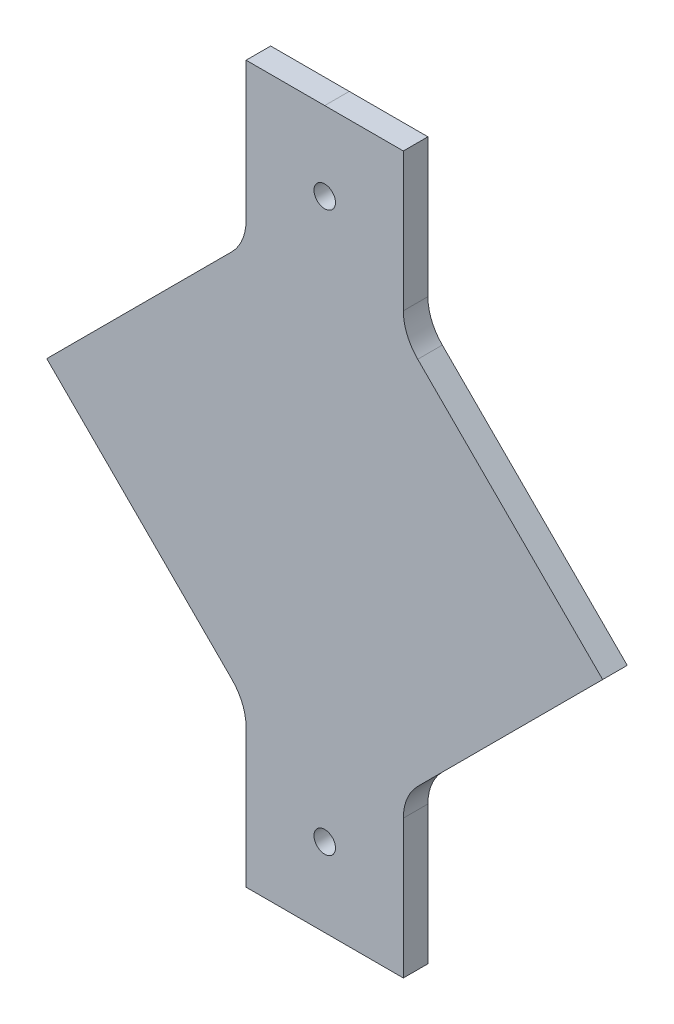
ISO-10303-21;
HEADER;
FILE_DESCRIPTION(('STEP AP214'),'2;1');
FILE_NAME('part.step','',(''),(''),'','','');
FILE_SCHEMA(('AUTOMOTIVE_DESIGN { 1 0 10303 214 1 1 1 1 }'));
ENDSEC;
DATA;
#1=APPLICATION_CONTEXT('core data for automotive mechanical design processes');
#2=APPLICATION_PROTOCOL_DEFINITION('international standard','automotive_design',2000,#1);
#3=PRODUCT_CONTEXT('',#1,'mechanical');
#4=PRODUCT('Part','Part','',(#3));
#5=PRODUCT_RELATED_PRODUCT_CATEGORY('part','',(#4));
#6=PRODUCT_DEFINITION_FORMATION('','',#4);
#7=PRODUCT_DEFINITION_CONTEXT('part definition',#1,'design');
#8=PRODUCT_DEFINITION('design','',#6,#7);
#9=PRODUCT_DEFINITION_SHAPE('','',#8);
#10=(LENGTH_UNIT() NAMED_UNIT(*) SI_UNIT(.MILLI.,.METRE.));
#11=(NAMED_UNIT(*) PLANE_ANGLE_UNIT() SI_UNIT($,.RADIAN.));
#12=(NAMED_UNIT(*) SI_UNIT($,.STERADIAN.) SOLID_ANGLE_UNIT());
#13=UNCERTAINTY_MEASURE_WITH_UNIT(LENGTH_MEASURE(1.E-05),#10,'distance_accuracy_value','');
#14=(GEOMETRIC_REPRESENTATION_CONTEXT(3) GLOBAL_UNCERTAINTY_ASSIGNED_CONTEXT((#13)) GLOBAL_UNIT_ASSIGNED_CONTEXT((#10,
#11,#12)) REPRESENTATION_CONTEXT('',''));
#15=CARTESIAN_POINT('',(0.,0.,0.));
#16=DIRECTION('',(0.,0.,1.));
#17=DIRECTION('',(1.,0.,0.));
#18=AXIS2_PLACEMENT_3D('',#15,#16,#17);
#19=CARTESIAN_POINT('',(20.32,-92.5624816196549,6.35));
#20=DIRECTION('',(0.,1.,0.));
#21=DIRECTION('',(0.,0.,1.));
#22=AXIS2_PLACEMENT_3D('',#19,#20,#21);
#23=PLANE('',#22);
#24=DIRECTION('',(0.,0.,1.));
#25=VECTOR('',#24,1.);
#26=CARTESIAN_POINT('',(0.,-92.5624816196549,6.35));
#27=LINE('',#26,#25);
#28=CARTESIAN_POINT('',(0.,-92.5624816196549,0.));
#29=VERTEX_POINT('',#28);
#30=CARTESIAN_POINT('',(0.,-92.5624816196549,6.35));
#31=VERTEX_POINT('',#30);
#32=EDGE_CURVE('E12',#29,#31,#27,.T.);
#33=ORIENTED_EDGE('',*,*,#32,.F.);
#34=DIRECTION('',(1.,0.,0.));
#35=VECTOR('',#34,1.);
#36=CARTESIAN_POINT('',(20.32,-92.5624816196549,0.));
#37=LINE('',#36,#35);
#38=CARTESIAN_POINT('',(20.32,-92.5624816196549,0.));
#39=VERTEX_POINT('',#38);
#40=EDGE_CURVE('E241',#29,#39,#37,.T.);
#41=ORIENTED_EDGE('',*,*,#40,.T.);
#42=DIRECTION('',(0.,0.,-1.));
#43=VECTOR('',#42,1.);
#44=CARTESIAN_POINT('',(20.32,-92.5624816196549,6.35));
#45=LINE('',#44,#43);
#46=CARTESIAN_POINT('',(20.32,-92.5624816196549,6.35));
#47=VERTEX_POINT('',#46);
#48=EDGE_CURVE('E179',#47,#39,#45,.T.);
#49=ORIENTED_EDGE('',*,*,#48,.F.);
#50=DIRECTION('',(1.,0.,0.));
#51=VECTOR('',#50,1.);
#52=CARTESIAN_POINT('',(20.32,-92.5624816196549,6.35));
#53=LINE('',#52,#51);
#54=EDGE_CURVE('E162',#31,#47,#53,.T.);
#55=ORIENTED_EDGE('',*,*,#54,.F.);
#56=EDGE_LOOP('',(#33,#41,#49,#55));
#57=FACE_BOUND('',#56,.T.);
#58=ADVANCED_FACE('F41',(#57),#23,.F.);
#59=CARTESIAN_POINT('',(20.32,92.5624816196549,6.35));
#60=DIRECTION('',(0.,-1.,0.));
#61=DIRECTION('',(0.,0.,-1.));
#62=AXIS2_PLACEMENT_3D('',#59,#60,#61);
#63=PLANE('',#62);
#64=DIRECTION('',(0.,0.,1.));
#65=VECTOR('',#64,1.);
#66=CARTESIAN_POINT('',(0.,92.5624816196549,6.35));
#67=LINE('',#66,#65);
#68=CARTESIAN_POINT('',(0.,92.5624816196549,0.));
#69=VERTEX_POINT('',#68);
#70=CARTESIAN_POINT('',(0.,92.5624816196549,6.35));
#71=VERTEX_POINT('',#70);
#72=EDGE_CURVE('E50',#69,#71,#67,.T.);
#73=ORIENTED_EDGE('',*,*,#72,.F.);
#74=DIRECTION('',(-1.,0.,0.));
#75=VECTOR('',#74,1.);
#76=CARTESIAN_POINT('',(20.32,92.5624816196549,0.));
#77=LINE('',#76,#75);
#78=CARTESIAN_POINT('',(-20.32,92.5624816196549,0.));
#79=VERTEX_POINT('',#78);
#80=EDGE_CURVE('E226',#69,#79,#77,.T.);
#81=ORIENTED_EDGE('',*,*,#80,.T.);
#82=DIRECTION('',(0.,0.,-1.));
#83=VECTOR('',#82,1.);
#84=CARTESIAN_POINT('',(-20.32,92.5624816196549,6.35));
#85=LINE('',#84,#83);
#86=CARTESIAN_POINT('',(-20.32,92.5624816196549,6.35));
#87=VERTEX_POINT('',#86);
#88=EDGE_CURVE('E202',#87,#79,#85,.T.);
#89=ORIENTED_EDGE('',*,*,#88,.F.);
#90=DIRECTION('',(-1.,0.,0.));
#91=VECTOR('',#90,1.);
#92=CARTESIAN_POINT('',(20.32,92.5624816196549,6.35));
#93=LINE('',#92,#91);
#94=EDGE_CURVE('E257',#71,#87,#93,.T.);
#95=ORIENTED_EDGE('',*,*,#94,.F.);
#96=EDGE_LOOP('',(#73,#81,#89,#95));
#97=FACE_BOUND('',#96,.T.);
#98=ADVANCED_FACE('F288',(#97),#63,.F.);
#99=CARTESIAN_POINT('',(-33.02,-56.7825612106915,6.35));
#100=DIRECTION('',(0.,0.,-1.));
#101=DIRECTION('',(-1.,0.,0.));
#102=AXIS2_PLACEMENT_3D('',#99,#100,#101);
#103=PLANE('',#102);
#104=CARTESIAN_POINT('',(0.,72.2424816196549,6.35));
#105=DIRECTION('',(0.,0.,1.));
#106=DIRECTION('',(1.,0.,0.));
#107=AXIS2_PLACEMENT_3D('',#104,#105,#106);
#108=CIRCLE('',#107,2.778125);
#109=CARTESIAN_POINT('',(2.778125,72.2424816196549,6.35));
#110=VERTEX_POINT('',#109);
#111=EDGE_CURVE('E245',#110,#110,#108,.T.);
#112=ORIENTED_EDGE('',*,*,#111,.F.);
#113=EDGE_LOOP('',(#112));
#114=FACE_BOUND('',#113,.T.);
#115=CARTESIAN_POINT('',(-33.02,-56.7825612106915,6.35));
#116=DIRECTION('',(0.,0.,-1.));
#117=DIRECTION('',(-1.,0.,0.));
#118=AXIS2_PLACEMENT_3D('',#115,#116,#117);
#119=CIRCLE('',#118,12.7);
#120=CARTESIAN_POINT('',(-24.0397438789308,-47.8023050896224,6.35));
#121=VERTEX_POINT('',#120);
#122=CARTESIAN_POINT('',(-20.32,-56.7825612106915,6.35));
#123=VERTEX_POINT('',#122);
#124=EDGE_CURVE('E163',#121,#123,#119,.T.);
#125=ORIENTED_EDGE('',*,*,#124,.T.);
#126=DIRECTION('',(0.,-1.,0.));
#127=VECTOR('',#126,1.);
#128=CARTESIAN_POINT('',(-20.32,-92.5624816196549,6.35));
#129=LINE('',#128,#127);
#130=CARTESIAN_POINT('',(-20.32,-92.5624816196549,6.35));
#131=VERTEX_POINT('',#130);
#132=EDGE_CURVE('E152',#123,#131,#129,.T.);
#133=ORIENTED_EDGE('',*,*,#132,.T.);
#134=EDGE_CURVE('E270',#131,#31,#53,.T.);
#135=ORIENTED_EDGE('',*,*,#134,.T.);
#136=ORIENTED_EDGE('',*,*,#54,.T.);
#137=DIRECTION('',(0.,1.,0.));
#138=VECTOR('',#137,1.);
#139=CARTESIAN_POINT('',(20.32,-92.5624816196549,6.35));
#140=LINE('',#139,#138);
#141=CARTESIAN_POINT('',(20.32,-56.7825612106915,6.35));
#142=VERTEX_POINT('',#141);
#143=EDGE_CURVE('E267',#47,#142,#140,.T.);
#144=ORIENTED_EDGE('',*,*,#143,.T.);
#145=CARTESIAN_POINT('',(33.02,-56.7825612106915,6.35));
#146=DIRECTION('',(0.,0.,-1.));
#147=DIRECTION('',(-1.,0.,0.));
#148=AXIS2_PLACEMENT_3D('',#145,#146,#147);
#149=CIRCLE('',#148,12.7);
#150=CARTESIAN_POINT('',(24.0397438789308,-47.8023050896224,6.35));
#151=VERTEX_POINT('',#150);
#152=EDGE_CURVE('E266',#142,#151,#149,.T.);
#153=ORIENTED_EDGE('',*,*,#152,.T.);
#154=DIRECTION('',(0.707106781186548,0.707106781186547,0.));
#155=VECTOR('',#154,1.);
#156=CARTESIAN_POINT('',(71.8420489685532,0.,6.35));
#157=LINE('',#156,#155);
#158=CARTESIAN_POINT('',(71.8420489685532,0.,6.35));
#159=VERTEX_POINT('',#158);
#160=EDGE_CURVE('E264',#151,#159,#157,.T.);
#161=ORIENTED_EDGE('',*,*,#160,.T.);
#162=DIRECTION('',(-0.707106781186547,0.707106781186548,0.));
#163=VECTOR('',#162,1.);
#164=CARTESIAN_POINT('',(71.8420489685532,0.,6.35));
#165=LINE('',#164,#163);
#166=CARTESIAN_POINT('',(24.0397438789307,47.8023050896225,6.35));
#167=VERTEX_POINT('',#166);
#168=EDGE_CURVE('E262',#159,#167,#165,.T.);
#169=ORIENTED_EDGE('',*,*,#168,.T.);
#170=CARTESIAN_POINT('',(33.0199999999994,56.7825612106913,6.35));
#171=DIRECTION('',(0.,0.,-1.));
#172=DIRECTION('',(-1.,0.,0.));
#173=AXIS2_PLACEMENT_3D('',#170,#171,#172);
#174=CIRCLE('',#173,12.6999999999994);
#175=CARTESIAN_POINT('',(20.32,56.7825612106913,6.35));
#176=VERTEX_POINT('',#175);
#177=EDGE_CURVE('E260',#167,#176,#174,.T.);
#178=ORIENTED_EDGE('',*,*,#177,.T.);
#179=DIRECTION('',(0.,1.,0.));
#180=VECTOR('',#179,1.);
#181=CARTESIAN_POINT('',(20.32,92.5624816196549,6.35));
#182=LINE('',#181,#180);
#183=CARTESIAN_POINT('',(20.32,92.5624816196549,6.35));
#184=VERTEX_POINT('',#183);
#185=EDGE_CURVE('E258',#176,#184,#182,.T.);
#186=ORIENTED_EDGE('',*,*,#185,.T.);
#187=EDGE_CURVE('E254',#184,#71,#93,.T.);
#188=ORIENTED_EDGE('',*,*,#187,.T.);
#189=ORIENTED_EDGE('',*,*,#94,.T.);
#190=DIRECTION('',(0.,-1.,0.));
#191=VECTOR('',#190,1.);
#192=CARTESIAN_POINT('',(-20.32,92.5624816196549,6.35));
#193=LINE('',#192,#191);
#194=CARTESIAN_POINT('',(-20.32,56.7825612106915,6.35));
#195=VERTEX_POINT('',#194);
#196=EDGE_CURVE('E251',#87,#195,#193,.T.);
#197=ORIENTED_EDGE('',*,*,#196,.T.);
#198=CARTESIAN_POINT('',(-33.0199999999998,56.7825612106915,6.35));
#199=DIRECTION('',(0.,0.,-1.));
#200=DIRECTION('',(-1.,0.,0.));
#201=AXIS2_PLACEMENT_3D('',#198,#199,#200);
#202=CIRCLE('',#201,12.6999999999998);
#203=CARTESIAN_POINT('',(-24.0397438789308,47.8023050896224,6.35));
#204=VERTEX_POINT('',#203);
#205=EDGE_CURVE('E249',#195,#204,#202,.T.);
#206=ORIENTED_EDGE('',*,*,#205,.T.);
#207=DIRECTION('',(-0.707106781186548,-0.707106781186547,0.));
#208=VECTOR('',#207,1.);
#209=CARTESIAN_POINT('',(-24.0397438789308,47.8023050896224,6.35));
#210=LINE('',#209,#208);
#211=CARTESIAN_POINT('',(-71.8420489685532,0.,6.35));
#212=VERTEX_POINT('',#211);
#213=EDGE_CURVE('E247',#204,#212,#210,.T.);
#214=ORIENTED_EDGE('',*,*,#213,.T.);
#215=DIRECTION('',(0.707106781186548,-0.707106781186548,0.));
#216=VECTOR('',#215,1.);
#217=CARTESIAN_POINT('',(-24.0397438789308,-47.8023050896224,6.35));
#218=LINE('',#217,#216);
#219=EDGE_CURVE('E169',#212,#121,#218,.T.);
#220=ORIENTED_EDGE('',*,*,#219,.T.);
#221=EDGE_LOOP('',(#125,#133,#135,#136,#144,#153,#161,#169,#178,#186,#188,#189,#197,#206,#214,#220));
#222=FACE_BOUND('',#221,.T.);
#223=CARTESIAN_POINT('',(0.,-72.2424816196549,6.35));
#224=DIRECTION('',(0.,0.,1.));
#225=DIRECTION('',(1.,0.,0.));
#226=AXIS2_PLACEMENT_3D('',#223,#224,#225);
#227=CIRCLE('',#226,2.778125);
#228=CARTESIAN_POINT('',(2.77812500000002,-72.2424816196549,6.35));
#229=VERTEX_POINT('',#228);
#230=EDGE_CURVE('E275',#229,#229,#227,.T.);
#231=ORIENTED_EDGE('',*,*,#230,.F.);
#232=EDGE_LOOP('',(#231));
#233=FACE_BOUND('',#232,.T.);
#234=ADVANCED_FACE('F166',(#114,#222,#233),#103,.F.);
#235=CARTESIAN_POINT('',(-33.02,-56.7825612106915,0.));
#236=DIRECTION('',(0.,0.,-1.));
#237=DIRECTION('',(-1.,0.,0.));
#238=AXIS2_PLACEMENT_3D('',#235,#236,#237);
#239=PLANE('',#238);
#240=CARTESIAN_POINT('',(0.,72.2424816196549,0.));
#241=DIRECTION('',(0.,0.,1.));
#242=DIRECTION('',(1.,0.,0.));
#243=AXIS2_PLACEMENT_3D('',#240,#241,#242);
#244=CIRCLE('',#243,2.778125);
#245=CARTESIAN_POINT('',(2.778125,72.2424816196549,0.));
#246=VERTEX_POINT('',#245);
#247=EDGE_CURVE('E272',#246,#246,#244,.T.);
#248=ORIENTED_EDGE('',*,*,#247,.T.);
#249=EDGE_LOOP('',(#248));
#250=FACE_BOUND('',#249,.T.);
#251=CARTESIAN_POINT('',(-33.02,-56.7825612106915,0.));
#252=DIRECTION('',(0.,0.,-1.));
#253=DIRECTION('',(-1.,0.,0.));
#254=AXIS2_PLACEMENT_3D('',#251,#252,#253);
#255=CIRCLE('',#254,12.7);
#256=CARTESIAN_POINT('',(-24.0397438789308,-47.8023050896224,0.));
#257=VERTEX_POINT('',#256);
#258=CARTESIAN_POINT('',(-20.32,-56.7825612106915,0.));
#259=VERTEX_POINT('',#258);
#260=EDGE_CURVE('E176',#257,#259,#255,.T.);
#261=ORIENTED_EDGE('',*,*,#260,.F.);
#262=DIRECTION('',(0.707106781186548,-0.707106781186548,0.));
#263=VECTOR('',#262,1.);
#264=CARTESIAN_POINT('',(-24.0397438789308,-47.8023050896224,0.));
#265=LINE('',#264,#263);
#266=CARTESIAN_POINT('',(-71.8420489685532,0.,0.));
#267=VERTEX_POINT('',#266);
#268=EDGE_CURVE('E173',#267,#257,#265,.T.);
#269=ORIENTED_EDGE('',*,*,#268,.F.);
#270=DIRECTION('',(-0.707106781186548,-0.707106781186547,0.));
#271=VECTOR('',#270,1.);
#272=CARTESIAN_POINT('',(-24.0397438789308,47.8023050896224,0.));
#273=LINE('',#272,#271);
#274=CARTESIAN_POINT('',(-24.0397438789308,47.8023050896224,0.));
#275=VERTEX_POINT('',#274);
#276=EDGE_CURVE('E217',#275,#267,#273,.T.);
#277=ORIENTED_EDGE('',*,*,#276,.F.);
#278=CARTESIAN_POINT('',(-33.0199999999998,56.7825612106915,0.));
#279=DIRECTION('',(0.,0.,-1.));
#280=DIRECTION('',(-1.,0.,0.));
#281=AXIS2_PLACEMENT_3D('',#278,#279,#280);
#282=CIRCLE('',#281,12.6999999999998);
#283=CARTESIAN_POINT('',(-20.32,56.7825612106915,0.));
#284=VERTEX_POINT('',#283);
#285=EDGE_CURVE('E219',#284,#275,#282,.T.);
#286=ORIENTED_EDGE('',*,*,#285,.F.);
#287=DIRECTION('',(0.,-1.,0.));
#288=VECTOR('',#287,1.);
#289=CARTESIAN_POINT('',(-20.32,92.5624816196549,0.));
#290=LINE('',#289,#288);
#291=EDGE_CURVE('E221',#79,#284,#290,.T.);
#292=ORIENTED_EDGE('',*,*,#291,.F.);
#293=ORIENTED_EDGE('',*,*,#80,.F.);
#294=CARTESIAN_POINT('',(20.32,92.5624816196549,0.));
#295=VERTEX_POINT('',#294);
#296=EDGE_CURVE('E223',#295,#69,#77,.T.);
#297=ORIENTED_EDGE('',*,*,#296,.F.);
#298=DIRECTION('',(0.,1.,0.));
#299=VECTOR('',#298,1.);
#300=CARTESIAN_POINT('',(20.32,92.5624816196549,0.));
#301=LINE('',#300,#299);
#302=CARTESIAN_POINT('',(20.32,56.7825612106913,0.));
#303=VERTEX_POINT('',#302);
#304=EDGE_CURVE('E227',#303,#295,#301,.T.);
#305=ORIENTED_EDGE('',*,*,#304,.F.);
#306=CARTESIAN_POINT('',(33.0199999999994,56.7825612106913,0.));
#307=DIRECTION('',(0.,0.,-1.));
#308=DIRECTION('',(-1.,0.,0.));
#309=AXIS2_PLACEMENT_3D('',#306,#307,#308);
#310=CIRCLE('',#309,12.6999999999994);
#311=CARTESIAN_POINT('',(24.0397438789307,47.8023050896225,0.));
#312=VERTEX_POINT('',#311);
#313=EDGE_CURVE('E229',#312,#303,#310,.T.);
#314=ORIENTED_EDGE('',*,*,#313,.F.);
#315=DIRECTION('',(-0.707106781186547,0.707106781186548,0.));
#316=VECTOR('',#315,1.);
#317=CARTESIAN_POINT('',(71.8420489685532,0.,0.));
#318=LINE('',#317,#316);
#319=CARTESIAN_POINT('',(71.8420489685532,0.,0.));
#320=VERTEX_POINT('',#319);
#321=EDGE_CURVE('E231',#320,#312,#318,.T.);
#322=ORIENTED_EDGE('',*,*,#321,.F.);
#323=DIRECTION('',(0.707106781186548,0.707106781186547,0.));
#324=VECTOR('',#323,1.);
#325=CARTESIAN_POINT('',(71.8420489685532,0.,0.));
#326=LINE('',#325,#324);
#327=CARTESIAN_POINT('',(24.0397438789308,-47.8023050896224,0.));
#328=VERTEX_POINT('',#327);
#329=EDGE_CURVE('E233',#328,#320,#326,.T.);
#330=ORIENTED_EDGE('',*,*,#329,.F.);
#331=CARTESIAN_POINT('',(33.02,-56.7825612106915,0.));
#332=DIRECTION('',(0.,0.,-1.));
#333=DIRECTION('',(-1.,0.,0.));
#334=AXIS2_PLACEMENT_3D('',#331,#332,#333);
#335=CIRCLE('',#334,12.7);
#336=CARTESIAN_POINT('',(20.32,-56.7825612106915,0.));
#337=VERTEX_POINT('',#336);
#338=EDGE_CURVE('E235',#337,#328,#335,.T.);
#339=ORIENTED_EDGE('',*,*,#338,.F.);
#340=DIRECTION('',(0.,1.,0.));
#341=VECTOR('',#340,1.);
#342=CARTESIAN_POINT('',(20.32,-92.5624816196549,0.));
#343=LINE('',#342,#341);
#344=EDGE_CURVE('E237',#39,#337,#343,.T.);
#345=ORIENTED_EDGE('',*,*,#344,.F.);
#346=ORIENTED_EDGE('',*,*,#40,.F.);
#347=CARTESIAN_POINT('',(-20.32,-92.5624816196549,0.));
#348=VERTEX_POINT('',#347);
#349=EDGE_CURVE('E239',#348,#29,#37,.T.);
#350=ORIENTED_EDGE('',*,*,#349,.F.);
#351=DIRECTION('',(0.,-1.,0.));
#352=VECTOR('',#351,1.);
#353=CARTESIAN_POINT('',(-20.32,-92.5624816196549,0.));
#354=LINE('',#353,#352);
#355=EDGE_CURVE('E242',#259,#348,#354,.T.);
#356=ORIENTED_EDGE('',*,*,#355,.F.);
#357=EDGE_LOOP('',(#261,#269,#277,#286,#292,#293,#297,#305,#314,#322,#330,#339,#345,#346,#350,#356));
#358=FACE_BOUND('',#357,.T.);
#359=CARTESIAN_POINT('',(0.,-72.2424816196549,0.));
#360=DIRECTION('',(0.,0.,1.));
#361=DIRECTION('',(1.,0.,0.));
#362=AXIS2_PLACEMENT_3D('',#359,#360,#361);
#363=CIRCLE('',#362,2.778125);
#364=CARTESIAN_POINT('',(2.77812500000002,-72.2424816196549,0.));
#365=VERTEX_POINT('',#364);
#366=EDGE_CURVE('E278',#365,#365,#363,.T.);
#367=ORIENTED_EDGE('',*,*,#366,.T.);
#368=EDGE_LOOP('',(#367));
#369=FACE_BOUND('',#368,.T.);
#370=ADVANCED_FACE('F287',(#250,#358,#369),#239,.T.);
#371=CARTESIAN_POINT('',(-33.02,-56.7825612106915,6.35));
#372=DIRECTION('',(0.,0.,-1.));
#373=DIRECTION('',(-1.,0.,0.));
#374=AXIS2_PLACEMENT_3D('',#371,#372,#373);
#375=CYLINDRICAL_SURFACE('',#374,12.7);
#376=ORIENTED_EDGE('',*,*,#260,.T.);
#377=DIRECTION('',(0.,0.,-1.));
#378=VECTOR('',#377,1.);
#379=CARTESIAN_POINT('',(-20.32,-56.7825612106915,6.35));
#380=LINE('',#379,#378);
#381=EDGE_CURVE('E156',#123,#259,#380,.T.);
#382=ORIENTED_EDGE('',*,*,#381,.F.);
#383=ORIENTED_EDGE('',*,*,#124,.F.);
#384=DIRECTION('',(0.,0.,-1.));
#385=VECTOR('',#384,1.);
#386=CARTESIAN_POINT('',(-24.0397438789308,-47.8023050896224,6.35));
#387=LINE('',#386,#385);
#388=EDGE_CURVE('E214',#121,#257,#387,.T.);
#389=ORIENTED_EDGE('',*,*,#388,.T.);
#390=EDGE_LOOP('',(#376,#382,#383,#389));
#391=FACE_BOUND('',#390,.T.);
#392=ADVANCED_FACE('F43',(#391),#375,.F.);
#393=CARTESIAN_POINT('',(-20.32,-92.5624816196549,6.35));
#394=DIRECTION('',(1.,0.,0.));
#395=DIRECTION('',(0.,1.,0.));
#396=AXIS2_PLACEMENT_3D('',#393,#394,#395);
#397=PLANE('',#396);
#398=ORIENTED_EDGE('',*,*,#355,.T.);
#399=DIRECTION('',(0.,0.,-1.));
#400=VECTOR('',#399,1.);
#401=CARTESIAN_POINT('',(-20.32,-92.5624816196549,6.35));
#402=LINE('',#401,#400);
#403=EDGE_CURVE('E159',#131,#348,#402,.T.);
#404=ORIENTED_EDGE('',*,*,#403,.F.);
#405=ORIENTED_EDGE('',*,*,#132,.F.);
#406=ORIENTED_EDGE('',*,*,#381,.T.);
#407=EDGE_LOOP('',(#398,#404,#405,#406));
#408=FACE_BOUND('',#407,.T.);
#409=ADVANCED_FACE('F154',(#408),#397,.F.);
#410=ORIENTED_EDGE('',*,*,#349,.T.);
#411=ORIENTED_EDGE('',*,*,#32,.T.);
#412=ORIENTED_EDGE('',*,*,#134,.F.);
#413=ORIENTED_EDGE('',*,*,#403,.T.);
#414=EDGE_LOOP('',(#410,#411,#412,#413));
#415=FACE_BOUND('',#414,.T.);
#416=ADVANCED_FACE('F304',(#415),#23,.F.);
#417=CARTESIAN_POINT('',(20.32,-92.5624816196549,6.35));
#418=DIRECTION('',(-1.,0.,0.));
#419=DIRECTION('',(0.,-1.,0.));
#420=AXIS2_PLACEMENT_3D('',#417,#418,#419);
#421=PLANE('',#420);
#422=ORIENTED_EDGE('',*,*,#344,.T.);
#423=DIRECTION('',(0.,0.,-1.));
#424=VECTOR('',#423,1.);
#425=CARTESIAN_POINT('',(20.32,-56.7825612106915,6.35));
#426=LINE('',#425,#424);
#427=EDGE_CURVE('E184',#142,#337,#426,.T.);
#428=ORIENTED_EDGE('',*,*,#427,.F.);
#429=ORIENTED_EDGE('',*,*,#143,.F.);
#430=ORIENTED_EDGE('',*,*,#48,.T.);
#431=EDGE_LOOP('',(#422,#428,#429,#430));
#432=FACE_BOUND('',#431,.T.);
#433=ADVANCED_FACE('F309',(#432),#421,.F.);
#434=CARTESIAN_POINT('',(33.02,-56.7825612106915,6.35));
#435=DIRECTION('',(0.,0.,-1.));
#436=DIRECTION('',(-1.,0.,0.));
#437=AXIS2_PLACEMENT_3D('',#434,#435,#436);
#438=CYLINDRICAL_SURFACE('',#437,12.7);
#439=ORIENTED_EDGE('',*,*,#338,.T.);
#440=DIRECTION('',(0.,0.,-1.));
#441=VECTOR('',#440,1.);
#442=CARTESIAN_POINT('',(24.0397438789308,-47.8023050896224,6.35));
#443=LINE('',#442,#441);
#444=EDGE_CURVE('E187',#151,#328,#443,.T.);
#445=ORIENTED_EDGE('',*,*,#444,.F.);
#446=ORIENTED_EDGE('',*,*,#152,.F.);
#447=ORIENTED_EDGE('',*,*,#427,.T.);
#448=EDGE_LOOP('',(#439,#445,#446,#447));
#449=FACE_BOUND('',#448,.T.);
#450=ADVANCED_FACE('F314',(#449),#438,.F.);
#451=CARTESIAN_POINT('',(71.8420489685532,0.,6.35));
#452=DIRECTION('',(-0.707106781186547,0.707106781186548,0.));
#453=DIRECTION('',(-0.707106781186548,-0.707106781186547,0.));
#454=AXIS2_PLACEMENT_3D('',#451,#452,#453);
#455=PLANE('',#454);
#456=ORIENTED_EDGE('',*,*,#329,.T.);
#457=DIRECTION('',(0.,0.,-1.));
#458=VECTOR('',#457,1.);
#459=CARTESIAN_POINT('',(71.8420489685532,0.,6.35));
#460=LINE('',#459,#458);
#461=EDGE_CURVE('E190',#159,#320,#460,.T.);
#462=ORIENTED_EDGE('',*,*,#461,.F.);
#463=ORIENTED_EDGE('',*,*,#160,.F.);
#464=ORIENTED_EDGE('',*,*,#444,.T.);
#465=EDGE_LOOP('',(#456,#462,#463,#464));
#466=FACE_BOUND('',#465,.T.);
#467=ADVANCED_FACE('F331',(#466),#455,.F.);
#468=CARTESIAN_POINT('',(71.8420489685532,0.,6.35));
#469=DIRECTION('',(-0.707106781186548,-0.707106781186547,0.));
#470=DIRECTION('',(0.707106781186547,-0.707106781186548,0.));
#471=AXIS2_PLACEMENT_3D('',#468,#469,#470);
#472=PLANE('',#471);
#473=ORIENTED_EDGE('',*,*,#321,.T.);
#474=DIRECTION('',(0.,0.,-1.));
#475=VECTOR('',#474,1.);
#476=CARTESIAN_POINT('',(24.0397438789307,47.8023050896225,6.35));
#477=LINE('',#476,#475);
#478=EDGE_CURVE('E193',#167,#312,#477,.T.);
#479=ORIENTED_EDGE('',*,*,#478,.F.);
#480=ORIENTED_EDGE('',*,*,#168,.F.);
#481=ORIENTED_EDGE('',*,*,#461,.T.);
#482=EDGE_LOOP('',(#473,#479,#480,#481));
#483=FACE_BOUND('',#482,.T.);
#484=ADVANCED_FACE('F336',(#483),#472,.F.);
#485=CARTESIAN_POINT('',(33.0199999999994,56.7825612106913,6.35));
#486=DIRECTION('',(0.,0.,-1.));
#487=DIRECTION('',(-1.,0.,0.));
#488=AXIS2_PLACEMENT_3D('',#485,#486,#487);
#489=CYLINDRICAL_SURFACE('',#488,12.6999999999994);
#490=ORIENTED_EDGE('',*,*,#313,.T.);
#491=DIRECTION('',(0.,0.,-1.));
#492=VECTOR('',#491,1.);
#493=CARTESIAN_POINT('',(20.32,56.7825612106913,6.35));
#494=LINE('',#493,#492);
#495=EDGE_CURVE('E196',#176,#303,#494,.T.);
#496=ORIENTED_EDGE('',*,*,#495,.F.);
#497=ORIENTED_EDGE('',*,*,#177,.F.);
#498=ORIENTED_EDGE('',*,*,#478,.T.);
#499=EDGE_LOOP('',(#490,#496,#497,#498));
#500=FACE_BOUND('',#499,.T.);
#501=ADVANCED_FACE('F342',(#500),#489,.F.);
#502=CARTESIAN_POINT('',(20.32,92.5624816196549,6.35));
#503=DIRECTION('',(-1.,0.,0.));
#504=DIRECTION('',(0.,-1.,0.));
#505=AXIS2_PLACEMENT_3D('',#502,#503,#504);
#506=PLANE('',#505);
#507=ORIENTED_EDGE('',*,*,#304,.T.);
#508=DIRECTION('',(0.,0.,-1.));
#509=VECTOR('',#508,1.);
#510=CARTESIAN_POINT('',(20.32,92.5624816196549,6.35));
#511=LINE('',#510,#509);
#512=EDGE_CURVE('E199',#184,#295,#511,.T.);
#513=ORIENTED_EDGE('',*,*,#512,.F.);
#514=ORIENTED_EDGE('',*,*,#185,.F.);
#515=ORIENTED_EDGE('',*,*,#495,.T.);
#516=EDGE_LOOP('',(#507,#513,#514,#515));
#517=FACE_BOUND('',#516,.T.);
#518=ADVANCED_FACE('F346',(#517),#506,.F.);
#519=ORIENTED_EDGE('',*,*,#296,.T.);
#520=ORIENTED_EDGE('',*,*,#72,.T.);
#521=ORIENTED_EDGE('',*,*,#187,.F.);
#522=ORIENTED_EDGE('',*,*,#512,.T.);
#523=EDGE_LOOP('',(#519,#520,#521,#522));
#524=FACE_BOUND('',#523,.T.);
#525=ADVANCED_FACE('F299',(#524),#63,.F.);
#526=CARTESIAN_POINT('',(-20.32,92.5624816196549,6.35));
#527=DIRECTION('',(1.,0.,0.));
#528=DIRECTION('',(0.,1.,0.));
#529=AXIS2_PLACEMENT_3D('',#526,#527,#528);
#530=PLANE('',#529);
#531=ORIENTED_EDGE('',*,*,#291,.T.);
#532=DIRECTION('',(0.,0.,-1.));
#533=VECTOR('',#532,1.);
#534=CARTESIAN_POINT('',(-20.32,56.7825612106915,6.35));
#535=LINE('',#534,#533);
#536=EDGE_CURVE('E205',#195,#284,#535,.T.);
#537=ORIENTED_EDGE('',*,*,#536,.F.);
#538=ORIENTED_EDGE('',*,*,#196,.F.);
#539=ORIENTED_EDGE('',*,*,#88,.T.);
#540=EDGE_LOOP('',(#531,#537,#538,#539));
#541=FACE_BOUND('',#540,.T.);
#542=ADVANCED_FACE('F357',(#541),#530,.F.);
#543=CARTESIAN_POINT('',(-33.0199999999998,56.7825612106915,6.35));
#544=DIRECTION('',(0.,0.,-1.));
#545=DIRECTION('',(-1.,0.,0.));
#546=AXIS2_PLACEMENT_3D('',#543,#544,#545);
#547=CYLINDRICAL_SURFACE('',#546,12.6999999999998);
#548=ORIENTED_EDGE('',*,*,#285,.T.);
#549=DIRECTION('',(0.,0.,-1.));
#550=VECTOR('',#549,1.);
#551=CARTESIAN_POINT('',(-24.0397438789308,47.8023050896224,6.35));
#552=LINE('',#551,#550);
#553=EDGE_CURVE('E208',#204,#275,#552,.T.);
#554=ORIENTED_EDGE('',*,*,#553,.F.);
#555=ORIENTED_EDGE('',*,*,#205,.F.);
#556=ORIENTED_EDGE('',*,*,#536,.T.);
#557=EDGE_LOOP('',(#548,#554,#555,#556));
#558=FACE_BOUND('',#557,.T.);
#559=ADVANCED_FACE('F362',(#558),#547,.F.);
#560=CARTESIAN_POINT('',(-24.0397438789308,47.8023050896224,6.35));
#561=DIRECTION('',(0.707106781186547,-0.707106781186548,0.));
#562=DIRECTION('',(0.707106781186548,0.707106781186547,0.));
#563=AXIS2_PLACEMENT_3D('',#560,#561,#562);
#564=PLANE('',#563);
#565=ORIENTED_EDGE('',*,*,#276,.T.);
#566=DIRECTION('',(0.,0.,-1.));
#567=VECTOR('',#566,1.);
#568=CARTESIAN_POINT('',(-71.8420489685532,0.,6.35));
#569=LINE('',#568,#567);
#570=EDGE_CURVE('E211',#212,#267,#569,.T.);
#571=ORIENTED_EDGE('',*,*,#570,.F.);
#572=ORIENTED_EDGE('',*,*,#213,.F.);
#573=ORIENTED_EDGE('',*,*,#553,.T.);
#574=EDGE_LOOP('',(#565,#571,#572,#573));
#575=FACE_BOUND('',#574,.T.);
#576=ADVANCED_FACE('F366',(#575),#564,.F.);
#577=CARTESIAN_POINT('',(-24.0397438789308,-47.8023050896224,6.35));
#578=DIRECTION('',(0.707106781186548,0.707106781186548,0.));
#579=DIRECTION('',(-0.707106781186548,0.707106781186548,0.));
#580=AXIS2_PLACEMENT_3D('',#577,#578,#579);
#581=PLANE('',#580);
#582=ORIENTED_EDGE('',*,*,#268,.T.);
#583=ORIENTED_EDGE('',*,*,#388,.F.);
#584=ORIENTED_EDGE('',*,*,#219,.F.);
#585=ORIENTED_EDGE('',*,*,#570,.T.);
#586=EDGE_LOOP('',(#582,#583,#584,#585));
#587=FACE_BOUND('',#586,.T.);
#588=ADVANCED_FACE('F370',(#587),#581,.F.);
#589=CARTESIAN_POINT('',(0.,72.2424816196549,6.35));
#590=DIRECTION('',(0.,0.,-1.));
#591=DIRECTION('',(-1.,0.,0.));
#592=AXIS2_PLACEMENT_3D('',#589,#590,#591);
#593=CYLINDRICAL_SURFACE('',#592,2.778125);
#594=ORIENTED_EDGE('',*,*,#111,.T.);
#595=EDGE_LOOP('',(#594));
#596=FACE_BOUND('',#595,.T.);
#597=ORIENTED_EDGE('',*,*,#247,.F.);
#598=EDGE_LOOP('',(#597));
#599=FACE_BOUND('',#598,.T.);
#600=ADVANCED_FACE('F372',(#596,#599),#593,.F.);
#601=CARTESIAN_POINT('',(0.,-72.2424816196549,6.35));
#602=DIRECTION('',(0.,0.,-1.));
#603=DIRECTION('',(-1.,0.,0.));
#604=AXIS2_PLACEMENT_3D('',#601,#602,#603);
#605=CYLINDRICAL_SURFACE('',#604,2.778125);
#606=ORIENTED_EDGE('',*,*,#230,.T.);
#607=EDGE_LOOP('',(#606));
#608=FACE_BOUND('',#607,.T.);
#609=ORIENTED_EDGE('',*,*,#366,.F.);
#610=EDGE_LOOP('',(#609));
#611=FACE_BOUND('',#610,.T.);
#612=ADVANCED_FACE('F284',(#608,#611),#605,.F.);
#613=CLOSED_SHELL('',(#58,#98,#234,#370,#392,#409,#416,#433,#450,#467,#484,#501,#518,#525,#542,
#559,#576,#588,#600,#612));
#614=MANIFOLD_SOLID_BREP('B2',#613);
#615=ADVANCED_BREP_SHAPE_REPRESENTATION('',(#18,#614),#14);
#616=SHAPE_DEFINITION_REPRESENTATION(#9,#615);
ENDSEC;
END-ISO-10303-21;
